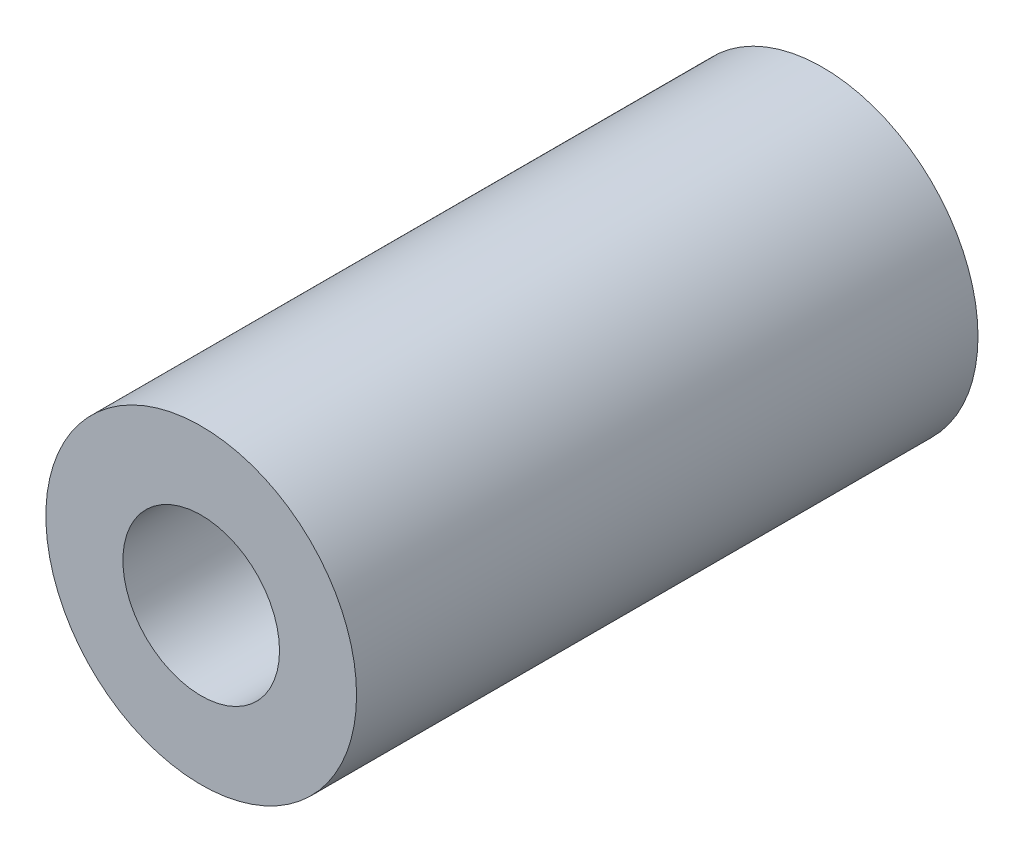
ISO-10303-21;
HEADER;
FILE_DESCRIPTION(('STEP AP214'),'2;1');
FILE_NAME('part.step','',(''),(''),'','','');
FILE_SCHEMA(('AUTOMOTIVE_DESIGN { 1 0 10303 214 1 1 1 1 }'));
ENDSEC;
DATA;
#1=APPLICATION_CONTEXT('core data for automotive mechanical design processes');
#2=APPLICATION_PROTOCOL_DEFINITION('international standard','automotive_design',2000,#1);
#3=PRODUCT_CONTEXT('',#1,'mechanical');
#4=PRODUCT('Part','Part','',(#3));
#5=PRODUCT_RELATED_PRODUCT_CATEGORY('part','',(#4));
#6=PRODUCT_DEFINITION_FORMATION('','',#4);
#7=PRODUCT_DEFINITION_CONTEXT('part definition',#1,'design');
#8=PRODUCT_DEFINITION('design','',#6,#7);
#9=PRODUCT_DEFINITION_SHAPE('','',#8);
#10=(LENGTH_UNIT() NAMED_UNIT(*) SI_UNIT(.MILLI.,.METRE.));
#11=(NAMED_UNIT(*) PLANE_ANGLE_UNIT() SI_UNIT($,.RADIAN.));
#12=(NAMED_UNIT(*) SI_UNIT($,.STERADIAN.) SOLID_ANGLE_UNIT());
#13=UNCERTAINTY_MEASURE_WITH_UNIT(LENGTH_MEASURE(1.E-05),#10,'distance_accuracy_value','');
#14=(GEOMETRIC_REPRESENTATION_CONTEXT(3) GLOBAL_UNCERTAINTY_ASSIGNED_CONTEXT((#13)) GLOBAL_UNIT_ASSIGNED_CONTEXT((#10,
#11,#12)) REPRESENTATION_CONTEXT('',''));
#15=CARTESIAN_POINT('',(0.,0.,0.));
#16=DIRECTION('',(0.,0.,1.));
#17=DIRECTION('',(1.,0.,0.));
#18=AXIS2_PLACEMENT_3D('',#15,#16,#17);
#19=CARTESIAN_POINT('',(0.,0.,12.7));
#20=DIRECTION('',(0.,0.,1.));
#21=DIRECTION('',(1.,0.,0.));
#22=AXIS2_PLACEMENT_3D('',#19,#20,#21);
#23=PLANE('',#22);
#24=CARTESIAN_POINT('',(0.,0.,12.7));
#25=DIRECTION('',(0.,0.,1.));
#26=DIRECTION('',(1.,0.,0.));
#27=AXIS2_PLACEMENT_3D('',#24,#25,#26);
#28=CIRCLE('',#27,6.35);
#29=CARTESIAN_POINT('',(6.35,0.,12.7));
#30=VERTEX_POINT('',#29);
#31=EDGE_CURVE('E10',#30,#30,#28,.T.);
#32=ORIENTED_EDGE('',*,*,#31,.T.);
#33=EDGE_LOOP('',(#32));
#34=FACE_BOUND('',#33,.T.);
#35=CARTESIAN_POINT('',(0.,0.,12.7));
#36=DIRECTION('',(0.,0.,1.));
#37=DIRECTION('',(1.,0.,0.));
#38=AXIS2_PLACEMENT_3D('',#35,#36,#37);
#39=CIRCLE('',#38,3.2004);
#40=CARTESIAN_POINT('',(3.2004,0.,12.7));
#41=VERTEX_POINT('',#40);
#42=EDGE_CURVE('E43',#41,#41,#39,.T.);
#43=ORIENTED_EDGE('',*,*,#42,.F.);
#44=EDGE_LOOP('',(#43));
#45=FACE_BOUND('',#44,.T.);
#46=ADVANCED_FACE('F32',(#34,#45),#23,.T.);
#47=CARTESIAN_POINT('',(0.,0.,-12.7));
#48=DIRECTION('',(0.,0.,1.));
#49=DIRECTION('',(1.,0.,0.));
#50=AXIS2_PLACEMENT_3D('',#47,#48,#49);
#51=PLANE('',#50);
#52=CARTESIAN_POINT('',(0.,0.,-12.7));
#53=DIRECTION('',(0.,0.,1.));
#54=DIRECTION('',(1.,0.,0.));
#55=AXIS2_PLACEMENT_3D('',#52,#53,#54);
#56=CIRCLE('',#55,6.35);
#57=CARTESIAN_POINT('',(6.35,0.,-12.7));
#58=VERTEX_POINT('',#57);
#59=EDGE_CURVE('E36',#58,#58,#56,.T.);
#60=ORIENTED_EDGE('',*,*,#59,.F.);
#61=EDGE_LOOP('',(#60));
#62=FACE_BOUND('',#61,.T.);
#63=CARTESIAN_POINT('',(0.,0.,-12.7));
#64=DIRECTION('',(0.,0.,1.));
#65=DIRECTION('',(1.,0.,0.));
#66=AXIS2_PLACEMENT_3D('',#63,#64,#65);
#67=CIRCLE('',#66,3.2004);
#68=CARTESIAN_POINT('',(3.2004,0.,-12.7));
#69=VERTEX_POINT('',#68);
#70=EDGE_CURVE('E45',#69,#69,#67,.T.);
#71=ORIENTED_EDGE('',*,*,#70,.T.);
#72=EDGE_LOOP('',(#71));
#73=FACE_BOUND('',#72,.T.);
#74=ADVANCED_FACE('F55',(#62,#73),#51,.F.);
#75=CARTESIAN_POINT('',(0.,0.,12.7));
#76=DIRECTION('',(0.,0.,-1.));
#77=DIRECTION('',(-1.,0.,0.));
#78=AXIS2_PLACEMENT_3D('',#75,#76,#77);
#79=CYLINDRICAL_SURFACE('',#78,6.35);
#80=ORIENTED_EDGE('',*,*,#31,.F.);
#81=EDGE_LOOP('',(#80));
#82=FACE_BOUND('',#81,.T.);
#83=ORIENTED_EDGE('',*,*,#59,.T.);
#84=EDGE_LOOP('',(#83));
#85=FACE_BOUND('',#84,.T.);
#86=ADVANCED_FACE('F34',(#82,#85),#79,.T.);
#87=CARTESIAN_POINT('',(0.,0.,12.7));
#88=DIRECTION('',(0.,0.,-1.));
#89=DIRECTION('',(-1.,0.,0.));
#90=AXIS2_PLACEMENT_3D('',#87,#88,#89);
#91=CYLINDRICAL_SURFACE('',#90,3.2004);
#92=ORIENTED_EDGE('',*,*,#42,.T.);
#93=EDGE_LOOP('',(#92));
#94=FACE_BOUND('',#93,.T.);
#95=ORIENTED_EDGE('',*,*,#70,.F.);
#96=EDGE_LOOP('',(#95));
#97=FACE_BOUND('',#96,.T.);
#98=ADVANCED_FACE('F51',(#94,#97),#91,.F.);
#99=CLOSED_SHELL('',(#46,#74,#86,#98));
#100=MANIFOLD_SOLID_BREP('B2',#99);
#101=ADVANCED_BREP_SHAPE_REPRESENTATION('',(#18,#100),#14);
#102=SHAPE_DEFINITION_REPRESENTATION(#9,#101);
ENDSEC;
END-ISO-10303-21;
